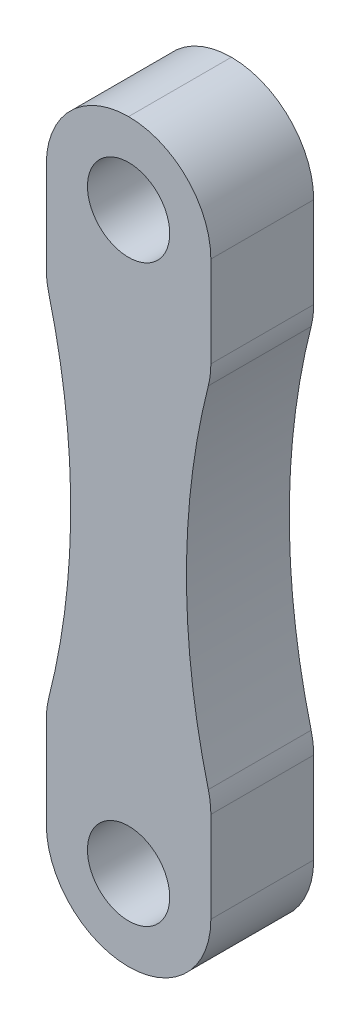
ISO-10303-21;
HEADER;
FILE_DESCRIPTION(('STEP AP214'),'2;1');
FILE_NAME('part.step','',(''),(''),'','','');
FILE_SCHEMA(('AUTOMOTIVE_DESIGN { 1 0 10303 214 1 1 1 1 }'));
ENDSEC;
DATA;
#1=APPLICATION_CONTEXT('core data for automotive mechanical design processes');
#2=APPLICATION_PROTOCOL_DEFINITION('international standard','automotive_design',2000,#1);
#3=PRODUCT_CONTEXT('',#1,'mechanical');
#4=PRODUCT('Part','Part','',(#3));
#5=PRODUCT_RELATED_PRODUCT_CATEGORY('part','',(#4));
#6=PRODUCT_DEFINITION_FORMATION('','',#4);
#7=PRODUCT_DEFINITION_CONTEXT('part definition',#1,'design');
#8=PRODUCT_DEFINITION('design','',#6,#7);
#9=PRODUCT_DEFINITION_SHAPE('','',#8);
#10=(LENGTH_UNIT() NAMED_UNIT(*) SI_UNIT(.MILLI.,.METRE.));
#11=(NAMED_UNIT(*) PLANE_ANGLE_UNIT() SI_UNIT($,.RADIAN.));
#12=(NAMED_UNIT(*) SI_UNIT($,.STERADIAN.) SOLID_ANGLE_UNIT());
#13=UNCERTAINTY_MEASURE_WITH_UNIT(LENGTH_MEASURE(1.E-05),#10,'distance_accuracy_value','');
#14=(GEOMETRIC_REPRESENTATION_CONTEXT(3) GLOBAL_UNCERTAINTY_ASSIGNED_CONTEXT((#13)) GLOBAL_UNIT_ASSIGNED_CONTEXT((#10,
#11,#12)) REPRESENTATION_CONTEXT('',''));
#15=CARTESIAN_POINT('',(0.,0.,0.));
#16=DIRECTION('',(0.,0.,1.));
#17=DIRECTION('',(1.,0.,0.));
#18=AXIS2_PLACEMENT_3D('',#15,#16,#17);
#19=CARTESIAN_POINT('',(8.00000000000015,35.8000000000003,5.));
#20=DIRECTION('',(-1.00000000000001,0.,0.));
#21=DIRECTION('',(0.,-1.00000000000001,0.));
#22=AXIS2_PLACEMENT_3D('',#19,#20,#21);
#23=PLANE('',#22);
#24=DIRECTION('',(0.,1.00000000000001,0.));
#25=VECTOR('',#24,1.);
#26=CARTESIAN_POINT('',(8.00000000000015,35.8000000000003,-4.99999999999997));
#27=LINE('',#26,#25);
#28=CARTESIAN_POINT('',(8.0000000000003,-27.8000000000002,-4.99999999999997));
#29=VERTEX_POINT('',#28);
#30=CARTESIAN_POINT('',(8.00000000000002,-18.9687028426324,-4.99999999999997));
#31=VERTEX_POINT('',#30);
#32=EDGE_CURVE('E307',#29,#31,#27,.T.);
#33=ORIENTED_EDGE('',*,*,#32,.T.);
#34=DIRECTION('',(0.,0.,-0.999999999999996));
#35=VECTOR('',#34,1.);
#36=CARTESIAN_POINT('',(8.00000000000013,-18.9687028426324,5.));
#37=LINE('',#36,#35);
#38=CARTESIAN_POINT('',(8.00000000000002,-18.9687028426324,5.));
#39=VERTEX_POINT('',#38);
#40=EDGE_CURVE('E257',#31,#39,#37,.F.);
#41=ORIENTED_EDGE('',*,*,#40,.T.);
#42=DIRECTION('',(0.,1.00000000000001,0.));
#43=VECTOR('',#42,1.);
#44=CARTESIAN_POINT('',(8.00000000000015,35.8000000000003,5.));
#45=LINE('',#44,#43);
#46=CARTESIAN_POINT('',(8.0000000000003,-27.8000000000002,5.));
#47=VERTEX_POINT('',#46);
#48=EDGE_CURVE('E198',#47,#39,#45,.T.);
#49=ORIENTED_EDGE('',*,*,#48,.F.);
#50=DIRECTION('',(0.,0.,-0.999999999999996));
#51=VECTOR('',#50,1.);
#52=CARTESIAN_POINT('',(8.00000000000021,-27.8000000000003,5.));
#53=LINE('',#52,#51);
#54=EDGE_CURVE('E253',#47,#29,#53,.T.);
#55=ORIENTED_EDGE('',*,*,#54,.T.);
#56=EDGE_LOOP('',(#33,#41,#49,#55));
#57=FACE_BOUND('',#56,.T.);
#58=ADVANCED_FACE('F47',(#57),#23,.F.);
#59=CARTESIAN_POINT('',(8.00000000000006,18.9687028426325,5.));
#60=VERTEX_POINT('',#59);
#61=CARTESIAN_POINT('',(8.00000000000013,27.8000000000003,5.));
#62=VERTEX_POINT('',#61);
#63=EDGE_CURVE('E300',#60,#62,#45,.T.);
#64=ORIENTED_EDGE('',*,*,#63,.F.);
#65=DIRECTION('',(0.,0.,-0.999999999999996));
#66=VECTOR('',#65,1.);
#67=CARTESIAN_POINT('',(8.00000000000008,18.9687028426325,-4.99999999999997));
#68=LINE('',#67,#66);
#69=CARTESIAN_POINT('',(8.00000000000006,18.9687028426325,-4.99999999999997));
#70=VERTEX_POINT('',#69);
#71=EDGE_CURVE('E11',#60,#70,#68,.T.);
#72=ORIENTED_EDGE('',*,*,#71,.T.);
#73=CARTESIAN_POINT('',(8.00000000000013,27.8000000000003,-4.99999999999997));
#74=VERTEX_POINT('',#73);
#75=EDGE_CURVE('E191',#70,#74,#27,.T.);
#76=ORIENTED_EDGE('',*,*,#75,.T.);
#77=DIRECTION('',(0.,0.,-0.999999999999996));
#78=VECTOR('',#77,1.);
#79=CARTESIAN_POINT('',(8.0000000000001,27.8000000000003,5.));
#80=LINE('',#79,#78);
#81=EDGE_CURVE('E57',#74,#62,#80,.F.);
#82=ORIENTED_EDGE('',*,*,#81,.T.);
#83=EDGE_LOOP('',(#64,#72,#76,#82));
#84=FACE_BOUND('',#83,.T.);
#85=ADVANCED_FACE('F366',(#84),#23,.F.);
#86=CARTESIAN_POINT('',(0.,0.,5.));
#87=DIRECTION('',(0.,0.,0.999999999999996));
#88=DIRECTION('',(1.00000000000001,0.,0.));
#89=AXIS2_PLACEMENT_3D('',#86,#87,#88);
#90=PLANE('',#89);
#91=CARTESIAN_POINT('',(0.,-27.9400000000002,5.));
#92=DIRECTION('',(0.,0.,-0.999999999999996));
#93=DIRECTION('',(1.00000000000001,0.,0.));
#94=AXIS2_PLACEMENT_3D('',#91,#92,#93);
#95=CIRCLE('',#94,4.);
#96=CARTESIAN_POINT('',(4.00000000000006,-27.9400000000002,5.));
#97=VERTEX_POINT('',#96);
#98=EDGE_CURVE('E179',#97,#97,#95,.T.);
#99=ORIENTED_EDGE('',*,*,#98,.T.);
#100=EDGE_LOOP('',(#99));
#101=FACE_BOUND('',#100,.T.);
#102=CARTESIAN_POINT('',(2.08166817117217E-13,27.9400000000004,5.));
#103=DIRECTION('',(0.,0.,0.999999999999996));
#104=DIRECTION('',(1.00000000000001,0.,0.));
#105=AXIS2_PLACEMENT_3D('',#102,#103,#104);
#106=CIRCLE('',#105,4.);
#107=CARTESIAN_POINT('',(4.00000000000025,27.9400000000004,5.));
#108=VERTEX_POINT('',#107);
#109=EDGE_CURVE('E309',#108,#108,#106,.T.);
#110=ORIENTED_EDGE('',*,*,#109,.F.);
#111=EDGE_LOOP('',(#110));
#112=FACE_BOUND('',#111,.T.);
#113=CARTESIAN_POINT('',(-74.6269945292454,0.,5.));
#114=DIRECTION('',(0.,0.,0.999999999999996));
#115=DIRECTION('',(1.00000000000001,0.,0.));
#116=AXIS2_PLACEMENT_3D('',#113,#114,#115);
#117=CIRCLE('',#116,69.);
#118=CARTESIAN_POINT('',(-7.75345397706433,-16.9979285213199,5.));
#119=VERTEX_POINT('',#118);
#120=CARTESIAN_POINT('',(-7.75345397706452,16.9979285213201,5.));
#121=VERTEX_POINT('',#120);
#122=EDGE_CURVE('E168',#119,#121,#117,.T.);
#123=ORIENTED_EDGE('',*,*,#122,.F.);
#124=CARTESIAN_POINT('',(0.,-18.9687028426323,5.));
#125=DIRECTION('',(0.,0.,0.999999999999996));
#126=DIRECTION('',(1.00000000000001,0.,0.));
#127=AXIS2_PLACEMENT_3D('',#124,#125,#126);
#128=CIRCLE('',#127,8.);
#129=CARTESIAN_POINT('',(-7.99999999999988,-18.9687028426323,5.));
#130=VERTEX_POINT('',#129);
#131=EDGE_CURVE('E150',#119,#130,#128,.T.);
#132=ORIENTED_EDGE('',*,*,#131,.T.);
#133=DIRECTION('',(0.,-1.00000000000001,0.));
#134=VECTOR('',#133,1.);
#135=CARTESIAN_POINT('',(-7.99999999999991,35.8000000000004,5.));
#136=LINE('',#135,#134);
#137=CARTESIAN_POINT('',(-7.99999999999995,-27.8000000000002,5.));
#138=VERTEX_POINT('',#137);
#139=EDGE_CURVE('E301',#130,#138,#136,.T.);
#140=ORIENTED_EDGE('',*,*,#139,.T.);
#141=CARTESIAN_POINT('',(0.,-27.8000000000002,5.));
#142=DIRECTION('',(0.,0.,0.999999999999996));
#143=DIRECTION('',(1.00000000000001,0.,0.));
#144=AXIS2_PLACEMENT_3D('',#141,#142,#143);
#145=CIRCLE('',#144,8.);
#146=CARTESIAN_POINT('',(0.,-35.8000000000003,5.));
#147=VERTEX_POINT('',#146);
#148=EDGE_CURVE('E205',#138,#147,#145,.T.);
#149=ORIENTED_EDGE('',*,*,#148,.T.);
#150=CARTESIAN_POINT('',(0.,-27.8000000000002,5.));
#151=DIRECTION('',(0.,0.,0.999999999999996));
#152=DIRECTION('',(1.00000000000001,0.,0.));
#153=AXIS2_PLACEMENT_3D('',#150,#151,#152);
#154=CIRCLE('',#153,8.);
#155=EDGE_CURVE('E208',#147,#47,#154,.T.);
#156=ORIENTED_EDGE('',*,*,#155,.T.);
#157=ORIENTED_EDGE('',*,*,#48,.T.);
#158=CARTESIAN_POINT('',(0.,-18.9687028426324,5.));
#159=DIRECTION('',(0.,0.,0.999999999999996));
#160=DIRECTION('',(1.00000000000001,0.,0.));
#161=AXIS2_PLACEMENT_3D('',#158,#159,#160);
#162=CIRCLE('',#161,8.);
#163=CARTESIAN_POINT('',(7.75345397706459,-16.9979285213199,5.));
#164=VERTEX_POINT('',#163);
#165=EDGE_CURVE('E214',#39,#164,#162,.T.);
#166=ORIENTED_EDGE('',*,*,#165,.T.);
#167=CARTESIAN_POINT('',(74.6269945292456,0.,5.));
#168=DIRECTION('',(0.,0.,0.999999999999996));
#169=DIRECTION('',(1.00000000000001,0.,0.));
#170=AXIS2_PLACEMENT_3D('',#167,#168,#169);
#171=CIRCLE('',#170,69.);
#172=CARTESIAN_POINT('',(7.75345397706455,16.9979285213199,5.));
#173=VERTEX_POINT('',#172);
#174=EDGE_CURVE('E187',#164,#173,#171,.F.);
#175=ORIENTED_EDGE('',*,*,#174,.T.);
#176=CARTESIAN_POINT('',(0.,18.9687028426325,5.));
#177=DIRECTION('',(0.,0.,0.999999999999996));
#178=DIRECTION('',(1.00000000000001,0.,0.));
#179=AXIS2_PLACEMENT_3D('',#176,#177,#178);
#180=CIRCLE('',#179,8.);
#181=EDGE_CURVE('E211',#173,#60,#180,.T.);
#182=ORIENTED_EDGE('',*,*,#181,.T.);
#183=ORIENTED_EDGE('',*,*,#63,.T.);
#184=CARTESIAN_POINT('',(0.,27.8000000000004,5.));
#185=DIRECTION('',(0.,0.,0.999999999999996));
#186=DIRECTION('',(1.00000000000001,0.,0.));
#187=AXIS2_PLACEMENT_3D('',#184,#185,#186);
#188=CIRCLE('',#187,8.);
#189=CARTESIAN_POINT('',(0.,35.8000000000003,5.));
#190=VERTEX_POINT('',#189);
#191=EDGE_CURVE('E202',#62,#190,#188,.T.);
#192=ORIENTED_EDGE('',*,*,#191,.T.);
#193=CARTESIAN_POINT('',(0.,27.8000000000004,5.));
#194=DIRECTION('',(0.,0.,0.999999999999996));
#195=DIRECTION('',(1.00000000000001,0.,0.));
#196=AXIS2_PLACEMENT_3D('',#193,#194,#195);
#197=CIRCLE('',#196,8.);
#198=CARTESIAN_POINT('',(-7.99999999999995,27.8000000000003,5.));
#199=VERTEX_POINT('',#198);
#200=EDGE_CURVE('E173',#190,#199,#197,.T.);
#201=ORIENTED_EDGE('',*,*,#200,.T.);
#202=CARTESIAN_POINT('',(-7.99999999999994,18.9687028426325,5.));
#203=VERTEX_POINT('',#202);
#204=EDGE_CURVE('E292',#199,#203,#136,.T.);
#205=ORIENTED_EDGE('',*,*,#204,.T.);
#206=CARTESIAN_POINT('',(0.,18.9687028426325,5.));
#207=DIRECTION('',(0.,0.,0.999999999999996));
#208=DIRECTION('',(1.00000000000001,0.,0.));
#209=AXIS2_PLACEMENT_3D('',#206,#207,#208);
#210=CIRCLE('',#209,8.);
#211=EDGE_CURVE('E162',#203,#121,#210,.T.);
#212=ORIENTED_EDGE('',*,*,#211,.T.);
#213=EDGE_LOOP('',(#123,#132,#140,#149,#156,#157,#166,#175,#182,#183,#192,#201,#205,#212));
#214=FACE_BOUND('',#213,.T.);
#215=ADVANCED_FACE('F176',(#101,#112,#214),#90,.T.);
#216=CARTESIAN_POINT('',(0.,0.,-4.99999999999997));
#217=DIRECTION('',(0.,0.,0.999999999999996));
#218=DIRECTION('',(1.00000000000001,0.,0.));
#219=AXIS2_PLACEMENT_3D('',#216,#217,#218);
#220=PLANE('',#219);
#221=CARTESIAN_POINT('',(2.08166817117217E-13,27.9400000000004,-4.99999999999997));
#222=DIRECTION('',(0.,0.,0.999999999999996));
#223=DIRECTION('',(1.00000000000001,0.,0.));
#224=AXIS2_PLACEMENT_3D('',#221,#222,#223);
#225=CIRCLE('',#224,4.);
#226=CARTESIAN_POINT('',(4.00000000000025,27.9400000000004,-4.99999999999997));
#227=VERTEX_POINT('',#226);
#228=EDGE_CURVE('E318',#227,#227,#225,.T.);
#229=ORIENTED_EDGE('',*,*,#228,.T.);
#230=EDGE_LOOP('',(#229));
#231=FACE_BOUND('',#230,.T.);
#232=CARTESIAN_POINT('',(0.,-27.9400000000002,-4.99999999999997));
#233=DIRECTION('',(0.,0.,-0.999999999999996));
#234=DIRECTION('',(1.00000000000001,0.,0.));
#235=AXIS2_PLACEMENT_3D('',#232,#233,#234);
#236=CIRCLE('',#235,4.);
#237=CARTESIAN_POINT('',(4.00000000000006,-27.9400000000002,-4.99999999999997));
#238=VERTEX_POINT('',#237);
#239=EDGE_CURVE('E185',#238,#238,#236,.T.);
#240=ORIENTED_EDGE('',*,*,#239,.F.);
#241=EDGE_LOOP('',(#240));
#242=FACE_BOUND('',#241,.T.);
#243=DIRECTION('',(0.,-1.00000000000001,0.));
#244=VECTOR('',#243,1.);
#245=CARTESIAN_POINT('',(-7.99999999999991,35.8000000000004,-4.99999999999997));
#246=LINE('',#245,#244);
#247=CARTESIAN_POINT('',(-7.99999999999988,-18.9687028426323,-4.99999999999997));
#248=VERTEX_POINT('',#247);
#249=CARTESIAN_POINT('',(-7.99999999999995,-27.8000000000002,-4.99999999999997));
#250=VERTEX_POINT('',#249);
#251=EDGE_CURVE('E313',#248,#250,#246,.T.);
#252=ORIENTED_EDGE('',*,*,#251,.F.);
#253=CARTESIAN_POINT('',(0.,-18.9687028426323,-4.99999999999997));
#254=DIRECTION('',(0.,0.,0.999999999999996));
#255=DIRECTION('',(1.00000000000001,0.,0.));
#256=AXIS2_PLACEMENT_3D('',#253,#254,#255);
#257=CIRCLE('',#256,8.);
#258=CARTESIAN_POINT('',(-7.75345397706433,-16.9979285213199,-4.99999999999997));
#259=VERTEX_POINT('',#258);
#260=EDGE_CURVE('E243',#248,#259,#257,.F.);
#261=ORIENTED_EDGE('',*,*,#260,.T.);
#262=CARTESIAN_POINT('',(-74.6269945292454,0.,-4.99999999999997));
#263=DIRECTION('',(0.,0.,0.999999999999996));
#264=DIRECTION('',(-1.00000000000001,0.,0.));
#265=AXIS2_PLACEMENT_3D('',#262,#263,#264);
#266=CIRCLE('',#265,69.);
#267=CARTESIAN_POINT('',(-7.75345397706452,16.9979285213201,-4.99999999999997));
#268=VERTEX_POINT('',#267);
#269=EDGE_CURVE('E171',#259,#268,#266,.T.);
#270=ORIENTED_EDGE('',*,*,#269,.T.);
#271=CARTESIAN_POINT('',(0.,18.9687028426325,-4.99999999999997));
#272=DIRECTION('',(0.,0.,0.999999999999996));
#273=DIRECTION('',(1.00000000000001,0.,0.));
#274=AXIS2_PLACEMENT_3D('',#271,#272,#273);
#275=CIRCLE('',#274,8.);
#276=CARTESIAN_POINT('',(-7.99999999999994,18.9687028426325,-4.99999999999997));
#277=VERTEX_POINT('',#276);
#278=EDGE_CURVE('E240',#268,#277,#275,.F.);
#279=ORIENTED_EDGE('',*,*,#278,.T.);
#280=CARTESIAN_POINT('',(-7.99999999999995,27.8000000000003,-4.99999999999997));
#281=VERTEX_POINT('',#280);
#282=EDGE_CURVE('E311',#281,#277,#246,.T.);
#283=ORIENTED_EDGE('',*,*,#282,.F.);
#284=CARTESIAN_POINT('',(0.,27.8000000000004,-4.99999999999997));
#285=DIRECTION('',(0.,0.,0.999999999999996));
#286=DIRECTION('',(1.00000000000001,0.,0.));
#287=AXIS2_PLACEMENT_3D('',#284,#285,#286);
#288=CIRCLE('',#287,8.);
#289=CARTESIAN_POINT('',(0.,35.8000000000003,-4.99999999999997));
#290=VERTEX_POINT('',#289);
#291=EDGE_CURVE('E223',#281,#290,#288,.F.);
#292=ORIENTED_EDGE('',*,*,#291,.T.);
#293=CARTESIAN_POINT('',(0.,27.8000000000004,-4.99999999999997));
#294=DIRECTION('',(0.,0.,0.999999999999996));
#295=DIRECTION('',(1.00000000000001,0.,0.));
#296=AXIS2_PLACEMENT_3D('',#293,#294,#295);
#297=CIRCLE('',#296,8.);
#298=EDGE_CURVE('E65',#290,#74,#297,.F.);
#299=ORIENTED_EDGE('',*,*,#298,.T.);
#300=ORIENTED_EDGE('',*,*,#75,.F.);
#301=CARTESIAN_POINT('',(0.,18.9687028426325,-4.99999999999997));
#302=DIRECTION('',(0.,0.,0.999999999999996));
#303=DIRECTION('',(1.00000000000001,0.,0.));
#304=AXIS2_PLACEMENT_3D('',#301,#302,#303);
#305=CIRCLE('',#304,8.);
#306=CARTESIAN_POINT('',(7.75345397706455,16.9979285213199,-4.99999999999997));
#307=VERTEX_POINT('',#306);
#308=EDGE_CURVE('E234',#70,#307,#305,.F.);
#309=ORIENTED_EDGE('',*,*,#308,.T.);
#310=CARTESIAN_POINT('',(74.6269945292456,0.,-4.99999999999997));
#311=DIRECTION('',(0.,0.,-0.999999999999996));
#312=DIRECTION('',(1.00000000000001,0.,0.));
#313=AXIS2_PLACEMENT_3D('',#310,#311,#312);
#314=CIRCLE('',#313,69.);
#315=CARTESIAN_POINT('',(7.75345397706459,-16.9979285213199,-4.99999999999997));
#316=VERTEX_POINT('',#315);
#317=EDGE_CURVE('E196',#316,#307,#314,.T.);
#318=ORIENTED_EDGE('',*,*,#317,.F.);
#319=CARTESIAN_POINT('',(0.,-18.9687028426324,-4.99999999999997));
#320=DIRECTION('',(0.,0.,0.999999999999996));
#321=DIRECTION('',(1.00000000000001,0.,0.));
#322=AXIS2_PLACEMENT_3D('',#319,#320,#321);
#323=CIRCLE('',#322,8.);
#324=EDGE_CURVE('E237',#316,#31,#323,.F.);
#325=ORIENTED_EDGE('',*,*,#324,.T.);
#326=ORIENTED_EDGE('',*,*,#32,.F.);
#327=CARTESIAN_POINT('',(0.,-27.8000000000002,-4.99999999999997));
#328=DIRECTION('',(0.,0.,0.999999999999996));
#329=DIRECTION('',(1.00000000000001,0.,0.));
#330=AXIS2_PLACEMENT_3D('',#327,#328,#329);
#331=CIRCLE('',#330,8.);
#332=CARTESIAN_POINT('',(0.,-35.8000000000003,-4.99999999999997));
#333=VERTEX_POINT('',#332);
#334=EDGE_CURVE('E231',#29,#333,#331,.F.);
#335=ORIENTED_EDGE('',*,*,#334,.T.);
#336=CARTESIAN_POINT('',(0.,-27.8000000000002,-4.99999999999997));
#337=DIRECTION('',(0.,0.,0.999999999999996));
#338=DIRECTION('',(1.00000000000001,0.,0.));
#339=AXIS2_PLACEMENT_3D('',#336,#337,#338);
#340=CIRCLE('',#339,8.);
#341=EDGE_CURVE('E228',#333,#250,#340,.F.);
#342=ORIENTED_EDGE('',*,*,#341,.T.);
#343=EDGE_LOOP('',(#252,#261,#270,#279,#283,#292,#299,#300,#309,#318,#325,#326,#335,#342));
#344=FACE_BOUND('',#343,.T.);
#345=ADVANCED_FACE('F339',(#231,#242,#344),#220,.F.);
#346=CARTESIAN_POINT('',(-7.99999999999991,35.8000000000004,5.));
#347=DIRECTION('',(1.00000000000001,0.,0.));
#348=DIRECTION('',(0.,1.00000000000001,0.));
#349=AXIS2_PLACEMENT_3D('',#346,#347,#348);
#350=PLANE('',#349);
#351=ORIENTED_EDGE('',*,*,#282,.T.);
#352=DIRECTION('',(0.,0.,0.999999999999996));
#353=VECTOR('',#352,1.);
#354=CARTESIAN_POINT('',(-8.00000000000006,18.9687028426324,5.));
#355=LINE('',#354,#353);
#356=EDGE_CURVE('E249',#277,#203,#355,.T.);
#357=ORIENTED_EDGE('',*,*,#356,.T.);
#358=ORIENTED_EDGE('',*,*,#204,.F.);
#359=DIRECTION('',(0.,0.,-0.999999999999996));
#360=VECTOR('',#359,1.);
#361=CARTESIAN_POINT('',(-7.99999999999995,27.8000000000003,5.));
#362=LINE('',#361,#360);
#363=EDGE_CURVE('E246',#199,#281,#362,.T.);
#364=ORIENTED_EDGE('',*,*,#363,.T.);
#365=EDGE_LOOP('',(#351,#357,#358,#364));
#366=FACE_BOUND('',#365,.T.);
#367=ADVANCED_FACE('F296',(#366),#350,.F.);
#368=ORIENTED_EDGE('',*,*,#139,.F.);
#369=DIRECTION('',(0.,0.,0.999999999999996));
#370=VECTOR('',#369,1.);
#371=CARTESIAN_POINT('',(-7.99999999999994,-18.9687028426324,5.));
#372=LINE('',#371,#370);
#373=EDGE_CURVE('E155',#130,#248,#372,.F.);
#374=ORIENTED_EDGE('',*,*,#373,.T.);
#375=ORIENTED_EDGE('',*,*,#251,.T.);
#376=DIRECTION('',(0.,0.,-0.999999999999996));
#377=VECTOR('',#376,1.);
#378=CARTESIAN_POINT('',(-7.9999999999999,-27.8000000000003,5.));
#379=LINE('',#378,#377);
#380=EDGE_CURVE('E161',#250,#138,#379,.F.);
#381=ORIENTED_EDGE('',*,*,#380,.T.);
#382=EDGE_LOOP('',(#368,#374,#375,#381));
#383=FACE_BOUND('',#382,.T.);
#384=ADVANCED_FACE('F347',(#383),#350,.F.);
#385=CARTESIAN_POINT('',(2.08166817117217E-13,27.9400000000004,-4.99999999999997));
#386=DIRECTION('',(0.,0.,0.999999999999996));
#387=DIRECTION('',(1.00000000000001,0.,0.));
#388=AXIS2_PLACEMENT_3D('',#385,#386,#387);
#389=CYLINDRICAL_SURFACE('',#388,4.);
#390=CARTESIAN_POINT('',(4.00000000000025,27.9400000000004,-4.99999999999997));
#391=CARTESIAN_POINT('',(4.00000000000025,27.9400000000004,-4.8958333333333));
#392=CARTESIAN_POINT('',(4.00000000000025,27.9400000000004,-4.79166666666664));
#393=CARTESIAN_POINT('',(4.00000000000025,27.9400000000004,-4.5833333333333));
#394=CARTESIAN_POINT('',(4.00000000000025,27.9400000000004,-4.47916666666664));
#395=CARTESIAN_POINT('',(4.00000000000025,27.9400000000004,-4.27083333333331));
#396=CARTESIAN_POINT('',(4.00000000000025,27.9400000000004,-4.16666666666664));
#397=CARTESIAN_POINT('',(4.00000000000025,27.9400000000004,-3.95833333333331));
#398=CARTESIAN_POINT('',(4.00000000000025,27.9400000000004,-3.85416666666664));
#399=CARTESIAN_POINT('',(4.00000000000025,27.9400000000004,-3.64583333333331));
#400=CARTESIAN_POINT('',(4.00000000000025,27.9400000000004,-3.54166666666664));
#401=CARTESIAN_POINT('',(4.00000000000025,27.9400000000004,-3.33333333333331));
#402=CARTESIAN_POINT('',(4.00000000000025,27.9400000000004,-3.22916666666664));
#403=CARTESIAN_POINT('',(4.00000000000025,27.9400000000004,-3.02083333333331));
#404=CARTESIAN_POINT('',(4.00000000000025,27.9400000000004,-2.91666666666664));
#405=CARTESIAN_POINT('',(4.00000000000025,27.9400000000004,-2.70833333333331));
#406=CARTESIAN_POINT('',(4.00000000000025,27.9400000000004,-2.60416666666664));
#407=CARTESIAN_POINT('',(4.00000000000025,27.9400000000004,-2.39583333333331));
#408=CARTESIAN_POINT('',(4.00000000000025,27.9400000000004,-2.29166666666665));
#409=CARTESIAN_POINT('',(4.00000000000025,27.9400000000004,-2.08333333333331));
#410=CARTESIAN_POINT('',(4.00000000000025,27.9400000000004,-1.97916666666665));
#411=CARTESIAN_POINT('',(4.00000000000025,27.9400000000004,-1.77083333333331));
#412=CARTESIAN_POINT('',(4.00000000000025,27.9400000000004,-1.66666666666665));
#413=CARTESIAN_POINT('',(4.00000000000025,27.9400000000004,-1.45833333333331));
#414=CARTESIAN_POINT('',(4.00000000000025,27.9400000000004,-1.35416666666665));
#415=CARTESIAN_POINT('',(4.00000000000025,27.9400000000004,-1.14583333333332));
#416=CARTESIAN_POINT('',(4.00000000000025,27.9400000000004,-1.04166666666665));
#417=CARTESIAN_POINT('',(4.00000000000025,27.9400000000004,-0.833333333333316));
#418=CARTESIAN_POINT('',(4.00000000000025,27.9400000000004,-0.72916666666665));
#419=CARTESIAN_POINT('',(4.00000000000025,27.9400000000004,-0.520833333333317));
#420=CARTESIAN_POINT('',(4.00000000000025,27.9400000000004,-0.416666666666651));
#421=CARTESIAN_POINT('',(4.00000000000025,27.9400000000004,-0.208333333333318));
#422=CARTESIAN_POINT('',(4.00000000000025,27.9400000000004,-0.104166666666652));
#423=CARTESIAN_POINT('',(4.00000000000025,27.9400000000004,0.104166666666681));
#424=CARTESIAN_POINT('',(4.00000000000025,27.9400000000004,0.208333333333348));
#425=CARTESIAN_POINT('',(4.00000000000025,27.9400000000004,0.41666666666668));
#426=CARTESIAN_POINT('',(4.00000000000025,27.9400000000004,0.520833333333347));
#427=CARTESIAN_POINT('',(4.00000000000025,27.9400000000004,0.729166666666679));
#428=CARTESIAN_POINT('',(4.00000000000025,27.9400000000004,0.833333333333346));
#429=CARTESIAN_POINT('',(4.00000000000025,27.9400000000004,1.04166666666668));
#430=CARTESIAN_POINT('',(4.00000000000025,27.9400000000004,1.14583333333334));
#431=CARTESIAN_POINT('',(4.00000000000025,27.9400000000004,1.35416666666668));
#432=CARTESIAN_POINT('',(4.00000000000025,27.9400000000004,1.45833333333334));
#433=CARTESIAN_POINT('',(4.00000000000025,27.9400000000004,1.66666666666668));
#434=CARTESIAN_POINT('',(4.00000000000025,27.9400000000004,1.77083333333334));
#435=CARTESIAN_POINT('',(4.00000000000025,27.9400000000004,1.97916666666668));
#436=CARTESIAN_POINT('',(4.00000000000025,27.9400000000004,2.08333333333334));
#437=CARTESIAN_POINT('',(4.00000000000025,27.9400000000004,2.29166666666667));
#438=CARTESIAN_POINT('',(4.00000000000025,27.9400000000004,2.39583333333334));
#439=CARTESIAN_POINT('',(4.00000000000025,27.9400000000004,2.60416666666667));
#440=CARTESIAN_POINT('',(4.00000000000025,27.9400000000004,2.70833333333334));
#441=CARTESIAN_POINT('',(4.00000000000025,27.9400000000004,2.91666666666667));
#442=CARTESIAN_POINT('',(4.00000000000025,27.9400000000004,3.02083333333334));
#443=CARTESIAN_POINT('',(4.00000000000025,27.9400000000004,3.22916666666667));
#444=CARTESIAN_POINT('',(4.00000000000025,27.9400000000004,3.33333333333334));
#445=CARTESIAN_POINT('',(4.00000000000025,27.9400000000004,3.54166666666667));
#446=CARTESIAN_POINT('',(4.00000000000025,27.9400000000004,3.64583333333334));
#447=CARTESIAN_POINT('',(4.00000000000025,27.9400000000004,3.85416666666667));
#448=CARTESIAN_POINT('',(4.00000000000025,27.9400000000004,3.95833333333334));
#449=CARTESIAN_POINT('',(4.00000000000025,27.9400000000004,4.16666666666667));
#450=CARTESIAN_POINT('',(4.00000000000025,27.9400000000004,4.27083333333333));
#451=CARTESIAN_POINT('',(4.00000000000025,27.9400000000004,4.47916666666667));
#452=CARTESIAN_POINT('',(4.00000000000025,27.9400000000004,4.58333333333333));
#453=CARTESIAN_POINT('',(4.00000000000025,27.9400000000004,4.79166666666667));
#454=CARTESIAN_POINT('',(4.00000000000025,27.9400000000004,4.89583333333333));
#455=CARTESIAN_POINT('',(4.00000000000025,27.9400000000004,5.));
#456=B_SPLINE_CURVE_WITH_KNOTS('',3,(#390,#391,#392,#393,#394,#395,#396,#397,#398,#399,#400,
#401,#402,#403,#404,#405,#406,#407,#408,#409,#410,#411,#412,#413,#414,#415,#416,#417,#418,#419,
#420,#421,#422,#423,#424,#425,#426,#427,#428,#429,#430,#431,#432,#433,#434,#435,#436,#437,#438,
#439,#440,#441,#442,#443,#444,#445,#446,#447,#448,#449,#450,#451,#452,#453,#454,#455),
.UNSPECIFIED.,.F.,.F.,(4,2,2,2,2,2,2,2,2,2,2,2,2,2,2,2,2,2,2,2,2,2,2,2,2,2,2,2,2,2,2,2,4),(0.,
0.312499999999999,0.624999999999998,0.937499999999996,1.25,1.56249999999999,1.87499999999999,
2.18749999999999,2.49999999999999,2.81249999999999,3.12499999999999,3.43749999999999,
3.74999999999999,4.06249999999999,4.37499999999999,4.68749999999998,4.99999999999998,
5.31249999999998,5.62499999999998,5.93749999999998,6.24999999999998,6.56249999999998,
6.87499999999998,7.18749999999998,7.49999999999998,7.81249999999998,8.12499999999998,
8.43749999999998,8.74999999999997,9.06249999999997,9.37499999999997,9.68749999999997,
9.99999999999997),.UNSPECIFIED.);
#457=EDGE_CURVE('BSEAM375',#227,#108,#456,.T.);
#458=ORIENTED_EDGE('',*,*,#228,.F.);
#459=ORIENTED_EDGE('',*,*,#109,.T.);
#460=ORIENTED_EDGE('',*,*,#457,.T.);
#461=ORIENTED_EDGE('',*,*,#457,.F.);
#462=EDGE_LOOP('',(#458,#460,#459,#461));
#463=FACE_BOUND('',#462,.T.);
#464=ADVANCED_FACE('F375',(#463),#389,.F.);
#465=CARTESIAN_POINT('',(0.,-27.9400000000002,-4.99999999999997));
#466=DIRECTION('',(0.,0.,0.999999999999996));
#467=DIRECTION('',(1.00000000000001,0.,0.));
#468=AXIS2_PLACEMENT_3D('',#465,#466,#467);
#469=CYLINDRICAL_SURFACE('',#468,4.);
#470=CARTESIAN_POINT('',(4.00000000000006,-27.9400000000002,-4.99999999999997));
#471=CARTESIAN_POINT('',(4.00000000000006,-27.9400000000002,-4.8958333333333));
#472=CARTESIAN_POINT('',(4.00000000000006,-27.9400000000002,-4.79166666666664));
#473=CARTESIAN_POINT('',(4.00000000000006,-27.9400000000002,-4.5833333333333));
#474=CARTESIAN_POINT('',(4.00000000000006,-27.9400000000002,-4.47916666666664));
#475=CARTESIAN_POINT('',(4.00000000000006,-27.9400000000002,-4.2708333333333));
#476=CARTESIAN_POINT('',(4.00000000000006,-27.9400000000002,-4.16666666666664));
#477=CARTESIAN_POINT('',(4.00000000000006,-27.9400000000002,-3.95833333333331));
#478=CARTESIAN_POINT('',(4.00000000000006,-27.9400000000002,-3.85416666666664));
#479=CARTESIAN_POINT('',(4.00000000000006,-27.9400000000002,-3.64583333333331));
#480=CARTESIAN_POINT('',(4.00000000000006,-27.9400000000002,-3.54166666666664));
#481=CARTESIAN_POINT('',(4.00000000000006,-27.9400000000002,-3.33333333333331));
#482=CARTESIAN_POINT('',(4.00000000000006,-27.9400000000002,-3.22916666666664));
#483=CARTESIAN_POINT('',(4.00000000000006,-27.9400000000002,-3.02083333333331));
#484=CARTESIAN_POINT('',(4.00000000000006,-27.9400000000002,-2.91666666666664));
#485=CARTESIAN_POINT('',(4.00000000000006,-27.9400000000002,-2.70833333333331));
#486=CARTESIAN_POINT('',(4.00000000000006,-27.9400000000002,-2.60416666666664));
#487=CARTESIAN_POINT('',(4.00000000000006,-27.9400000000002,-2.39583333333331));
#488=CARTESIAN_POINT('',(4.00000000000006,-27.9400000000002,-2.29166666666664));
#489=CARTESIAN_POINT('',(4.00000000000006,-27.9400000000002,-2.08333333333331));
#490=CARTESIAN_POINT('',(4.00000000000006,-27.9400000000002,-1.97916666666664));
#491=CARTESIAN_POINT('',(4.00000000000006,-27.9400000000002,-1.77083333333331));
#492=CARTESIAN_POINT('',(4.00000000000006,-27.9400000000002,-1.66666666666665));
#493=CARTESIAN_POINT('',(4.00000000000006,-27.9400000000002,-1.45833333333331));
#494=CARTESIAN_POINT('',(4.00000000000006,-27.9400000000002,-1.35416666666665));
#495=CARTESIAN_POINT('',(4.00000000000006,-27.9400000000002,-1.14583333333331));
#496=CARTESIAN_POINT('',(4.00000000000006,-27.9400000000002,-1.04166666666665));
#497=CARTESIAN_POINT('',(4.00000000000006,-27.9400000000002,-0.833333333333314));
#498=CARTESIAN_POINT('',(4.00000000000006,-27.9400000000002,-0.729166666666648));
#499=CARTESIAN_POINT('',(4.00000000000006,-27.9400000000002,-0.520833333333315));
#500=CARTESIAN_POINT('',(4.00000000000006,-27.9400000000002,-0.416666666666649));
#501=CARTESIAN_POINT('',(4.00000000000006,-27.9400000000002,-0.208333333333316));
#502=CARTESIAN_POINT('',(4.00000000000006,-27.9400000000002,-0.10416666666665));
#503=CARTESIAN_POINT('',(4.00000000000006,-27.9400000000002,0.104166666666683));
#504=CARTESIAN_POINT('',(4.00000000000006,-27.9400000000002,0.208333333333349));
#505=CARTESIAN_POINT('',(4.00000000000006,-27.9400000000002,0.416666666666682));
#506=CARTESIAN_POINT('',(4.00000000000006,-27.9400000000002,0.520833333333348));
#507=CARTESIAN_POINT('',(4.00000000000006,-27.9400000000002,0.729166666666681));
#508=CARTESIAN_POINT('',(4.00000000000006,-27.9400000000002,0.833333333333347));
#509=CARTESIAN_POINT('',(4.00000000000006,-27.9400000000002,1.04166666666668));
#510=CARTESIAN_POINT('',(4.00000000000006,-27.9400000000002,1.14583333333335));
#511=CARTESIAN_POINT('',(4.00000000000006,-27.9400000000002,1.35416666666668));
#512=CARTESIAN_POINT('',(4.00000000000006,-27.9400000000002,1.45833333333335));
#513=CARTESIAN_POINT('',(4.00000000000006,-27.9400000000002,1.66666666666668));
#514=CARTESIAN_POINT('',(4.00000000000006,-27.9400000000002,1.77083333333335));
#515=CARTESIAN_POINT('',(4.00000000000006,-27.9400000000002,1.97916666666668));
#516=CARTESIAN_POINT('',(4.00000000000006,-27.9400000000002,2.08333333333334));
#517=CARTESIAN_POINT('',(4.00000000000006,-27.9400000000002,2.29166666666668));
#518=CARTESIAN_POINT('',(4.00000000000006,-27.9400000000002,2.39583333333334));
#519=CARTESIAN_POINT('',(4.00000000000006,-27.9400000000002,2.60416666666668));
#520=CARTESIAN_POINT('',(4.00000000000006,-27.9400000000002,2.70833333333334));
#521=CARTESIAN_POINT('',(4.00000000000006,-27.9400000000002,2.91666666666668));
#522=CARTESIAN_POINT('',(4.00000000000006,-27.9400000000002,3.02083333333334));
#523=CARTESIAN_POINT('',(4.00000000000006,-27.9400000000002,3.22916666666667));
#524=CARTESIAN_POINT('',(4.00000000000006,-27.9400000000002,3.33333333333334));
#525=CARTESIAN_POINT('',(4.00000000000006,-27.9400000000002,3.54166666666667));
#526=CARTESIAN_POINT('',(4.00000000000006,-27.9400000000002,3.64583333333334));
#527=CARTESIAN_POINT('',(4.00000000000006,-27.9400000000002,3.85416666666667));
#528=CARTESIAN_POINT('',(4.00000000000006,-27.9400000000002,3.95833333333334));
#529=CARTESIAN_POINT('',(4.00000000000006,-27.9400000000002,4.16666666666667));
#530=CARTESIAN_POINT('',(4.00000000000006,-27.9400000000002,4.27083333333334));
#531=CARTESIAN_POINT('',(4.00000000000006,-27.9400000000002,4.47916666666667));
#532=CARTESIAN_POINT('',(4.00000000000006,-27.9400000000002,4.58333333333334));
#533=CARTESIAN_POINT('',(4.00000000000006,-27.9400000000002,4.79166666666667));
#534=CARTESIAN_POINT('',(4.00000000000006,-27.9400000000002,4.89583333333334));
#535=CARTESIAN_POINT('',(4.00000000000006,-27.9400000000002,5.));
#536=B_SPLINE_CURVE_WITH_KNOTS('',3,(#470,#471,#472,#473,#474,#475,#476,#477,#478,#479,#480,
#481,#482,#483,#484,#485,#486,#487,#488,#489,#490,#491,#492,#493,#494,#495,#496,#497,#498,#499,
#500,#501,#502,#503,#504,#505,#506,#507,#508,#509,#510,#511,#512,#513,#514,#515,#516,#517,#518,
#519,#520,#521,#522,#523,#524,#525,#526,#527,#528,#529,#530,#531,#532,#533,#534,#535),
.UNSPECIFIED.,.F.,.F.,(4,2,2,2,2,2,2,2,2,2,2,2,2,2,2,2,2,2,2,2,2,2,2,2,2,2,2,2,2,2,2,2,4),(0.,
0.312499999999999,0.624999999999999,0.937499999999997,1.25,1.5625,1.875,2.18749999999999,
2.49999999999999,2.81249999999999,3.12499999999999,3.43749999999999,3.74999999999999,
4.06249999999999,4.37499999999999,4.68749999999999,4.99999999999999,5.31249999999999,
5.62499999999998,5.93749999999998,6.24999999999998,6.56249999999998,6.87499999999998,
7.18749999999998,7.49999999999998,7.81249999999998,8.12499999999998,8.43749999999998,
8.74999999999998,9.06249999999998,9.37499999999997,9.68749999999997,9.99999999999997),.UNSPECIFIED.);
#537=EDGE_CURVE('BSEAM336',#238,#97,#536,.T.);
#538=ORIENTED_EDGE('',*,*,#239,.T.);
#539=ORIENTED_EDGE('',*,*,#98,.F.);
#540=ORIENTED_EDGE('',*,*,#537,.T.);
#541=ORIENTED_EDGE('',*,*,#537,.F.);
#542=EDGE_LOOP('',(#538,#540,#539,#541));
#543=FACE_BOUND('',#542,.T.);
#544=ADVANCED_FACE('F336',(#543),#469,.F.);
#545=CARTESIAN_POINT('',(-74.6269945292454,0.,-4.99999999999997));
#546=DIRECTION('',(0.,0.,0.999999999999996));
#547=DIRECTION('',(1.00000000000001,0.,0.));
#548=AXIS2_PLACEMENT_3D('',#545,#546,#547);
#549=CYLINDRICAL_SURFACE('',#548,69.);
#550=ORIENTED_EDGE('',*,*,#269,.F.);
#551=DIRECTION('',(0.,0.,0.999999999999996));
#552=VECTOR('',#551,1.);
#553=CARTESIAN_POINT('',(-7.75345397706433,-16.9979285213199,-4.99999999999997));
#554=LINE('',#553,#552);
#555=EDGE_CURVE('E154',#259,#119,#554,.T.);
#556=ORIENTED_EDGE('',*,*,#555,.T.);
#557=ORIENTED_EDGE('',*,*,#122,.T.);
#558=DIRECTION('',(0.,0.,0.999999999999996));
#559=VECTOR('',#558,1.);
#560=CARTESIAN_POINT('',(-7.75345397706452,16.9979285213201,-4.99999999999997));
#561=LINE('',#560,#559);
#562=EDGE_CURVE('E174',#121,#268,#561,.F.);
#563=ORIENTED_EDGE('',*,*,#562,.T.);
#564=EDGE_LOOP('',(#550,#556,#557,#563));
#565=FACE_BOUND('',#564,.T.);
#566=ADVANCED_FACE('F167',(#565),#549,.F.);
#567=CARTESIAN_POINT('',(74.6269945292456,0.,-4.99999999999997));
#568=DIRECTION('',(0.,0.,0.999999999999996));
#569=DIRECTION('',(1.00000000000001,0.,0.));
#570=AXIS2_PLACEMENT_3D('',#567,#568,#569);
#571=CYLINDRICAL_SURFACE('',#570,69.);
#572=ORIENTED_EDGE('',*,*,#174,.F.);
#573=DIRECTION('',(0.,0.,0.999999999999996));
#574=VECTOR('',#573,1.);
#575=CARTESIAN_POINT('',(7.75345397706458,-16.99792852132,-4.99999999999997));
#576=LINE('',#575,#574);
#577=EDGE_CURVE('E265',#164,#316,#576,.F.);
#578=ORIENTED_EDGE('',*,*,#577,.T.);
#579=ORIENTED_EDGE('',*,*,#317,.T.);
#580=DIRECTION('',(0.,0.,0.999999999999996));
#581=VECTOR('',#580,1.);
#582=CARTESIAN_POINT('',(7.7534539770647,16.99792852132,-4.99999999999997));
#583=LINE('',#582,#581);
#584=EDGE_CURVE('E261',#307,#173,#583,.T.);
#585=ORIENTED_EDGE('',*,*,#584,.T.);
#586=EDGE_LOOP('',(#572,#578,#579,#585));
#587=FACE_BOUND('',#586,.T.);
#588=ADVANCED_FACE('F379',(#587),#571,.F.);
#589=CARTESIAN_POINT('',(0.,-18.9687028426323,-4.99999999999997));
#590=DIRECTION('',(0.,0.,0.999999999999996));
#591=DIRECTION('',(1.00000000000001,0.,0.));
#592=AXIS2_PLACEMENT_3D('',#589,#590,#591);
#593=CYLINDRICAL_SURFACE('',#592,8.);
#594=ORIENTED_EDGE('',*,*,#260,.F.);
#595=ORIENTED_EDGE('',*,*,#373,.F.);
#596=ORIENTED_EDGE('',*,*,#131,.F.);
#597=ORIENTED_EDGE('',*,*,#555,.F.);
#598=EDGE_LOOP('',(#594,#595,#596,#597));
#599=FACE_BOUND('',#598,.T.);
#600=ADVANCED_FACE('F153',(#599),#593,.T.);
#601=CARTESIAN_POINT('',(0.,18.9687028426325,-4.99999999999997));
#602=DIRECTION('',(0.,0.,0.999999999999996));
#603=DIRECTION('',(1.00000000000001,0.,0.));
#604=AXIS2_PLACEMENT_3D('',#601,#602,#603);
#605=CYLINDRICAL_SURFACE('',#604,8.);
#606=ORIENTED_EDGE('',*,*,#278,.F.);
#607=ORIENTED_EDGE('',*,*,#562,.F.);
#608=ORIENTED_EDGE('',*,*,#211,.F.);
#609=ORIENTED_EDGE('',*,*,#356,.F.);
#610=EDGE_LOOP('',(#606,#607,#608,#609));
#611=FACE_BOUND('',#610,.T.);
#612=ADVANCED_FACE('F378',(#611),#605,.T.);
#613=CARTESIAN_POINT('',(0.,-18.9687028426324,-4.99999999999997));
#614=DIRECTION('',(0.,0.,0.999999999999996));
#615=DIRECTION('',(1.00000000000001,0.,0.));
#616=AXIS2_PLACEMENT_3D('',#613,#614,#615);
#617=CYLINDRICAL_SURFACE('',#616,8.);
#618=ORIENTED_EDGE('',*,*,#324,.F.);
#619=ORIENTED_EDGE('',*,*,#577,.F.);
#620=ORIENTED_EDGE('',*,*,#165,.F.);
#621=ORIENTED_EDGE('',*,*,#40,.F.);
#622=EDGE_LOOP('',(#618,#619,#620,#621));
#623=FACE_BOUND('',#622,.T.);
#624=ADVANCED_FACE('F382',(#623),#617,.T.);
#625=CARTESIAN_POINT('',(0.,18.9687028426325,-4.99999999999997));
#626=DIRECTION('',(0.,0.,0.999999999999996));
#627=DIRECTION('',(1.00000000000001,0.,0.));
#628=AXIS2_PLACEMENT_3D('',#625,#626,#627);
#629=CYLINDRICAL_SURFACE('',#628,8.);
#630=ORIENTED_EDGE('',*,*,#308,.F.);
#631=ORIENTED_EDGE('',*,*,#71,.F.);
#632=ORIENTED_EDGE('',*,*,#181,.F.);
#633=ORIENTED_EDGE('',*,*,#584,.F.);
#634=EDGE_LOOP('',(#630,#631,#632,#633));
#635=FACE_BOUND('',#634,.T.);
#636=ADVANCED_FACE('F362',(#635),#629,.T.);
#637=CARTESIAN_POINT('',(0.,-27.8000000000002,5.));
#638=DIRECTION('',(0.,0.,-0.999999999999996));
#639=DIRECTION('',(-1.00000000000001,0.,0.));
#640=AXIS2_PLACEMENT_3D('',#637,#638,#639);
#641=CYLINDRICAL_SURFACE('',#640,8.);
#642=DIRECTION('',(0.,0.,-0.999999999999996));
#643=VECTOR('',#642,1.);
#644=CARTESIAN_POINT('',(0.,-35.8000000000003,5.));
#645=LINE('',#644,#643);
#646=EDGE_CURVE('E270',#147,#333,#645,.T.);
#647=ORIENTED_EDGE('',*,*,#646,.F.);
#648=ORIENTED_EDGE('',*,*,#148,.F.);
#649=ORIENTED_EDGE('',*,*,#380,.F.);
#650=ORIENTED_EDGE('',*,*,#341,.F.);
#651=EDGE_LOOP('',(#647,#648,#649,#650));
#652=FACE_BOUND('',#651,.T.);
#653=ADVANCED_FACE('F345',(#652),#641,.T.);
#654=CARTESIAN_POINT('',(0.,-27.8000000000002,5.));
#655=DIRECTION('',(0.,0.,-0.999999999999996));
#656=DIRECTION('',(-1.00000000000001,0.,0.));
#657=AXIS2_PLACEMENT_3D('',#654,#655,#656);
#658=CYLINDRICAL_SURFACE('',#657,8.);
#659=ORIENTED_EDGE('',*,*,#155,.F.);
#660=ORIENTED_EDGE('',*,*,#646,.T.);
#661=ORIENTED_EDGE('',*,*,#334,.F.);
#662=ORIENTED_EDGE('',*,*,#54,.F.);
#663=EDGE_LOOP('',(#659,#660,#661,#662));
#664=FACE_BOUND('',#663,.T.);
#665=ADVANCED_FACE('F355',(#664),#658,.T.);
#666=CARTESIAN_POINT('',(0.,27.8000000000004,5.));
#667=DIRECTION('',(0.,0.,-0.999999999999996));
#668=DIRECTION('',(-1.00000000000001,0.,0.));
#669=AXIS2_PLACEMENT_3D('',#666,#667,#668);
#670=CYLINDRICAL_SURFACE('',#669,8.);
#671=ORIENTED_EDGE('',*,*,#363,.F.);
#672=ORIENTED_EDGE('',*,*,#200,.F.);
#673=DIRECTION('',(0.,0.,-0.999999999999996));
#674=VECTOR('',#673,1.);
#675=CARTESIAN_POINT('',(0.,35.8000000000003,5.));
#676=LINE('',#675,#674);
#677=EDGE_CURVE('E51',#290,#190,#676,.F.);
#678=ORIENTED_EDGE('',*,*,#677,.F.);
#679=ORIENTED_EDGE('',*,*,#291,.F.);
#680=EDGE_LOOP('',(#671,#672,#678,#679));
#681=FACE_BOUND('',#680,.T.);
#682=ADVANCED_FACE('F49',(#681),#670,.T.);
#683=CARTESIAN_POINT('',(0.,27.8000000000004,5.));
#684=DIRECTION('',(0.,0.,-0.999999999999996));
#685=DIRECTION('',(-1.00000000000001,0.,0.));
#686=AXIS2_PLACEMENT_3D('',#683,#684,#685);
#687=CYLINDRICAL_SURFACE('',#686,8.);
#688=ORIENTED_EDGE('',*,*,#191,.F.);
#689=ORIENTED_EDGE('',*,*,#81,.F.);
#690=ORIENTED_EDGE('',*,*,#298,.F.);
#691=ORIENTED_EDGE('',*,*,#677,.T.);
#692=EDGE_LOOP('',(#688,#689,#690,#691));
#693=FACE_BOUND('',#692,.T.);
#694=ADVANCED_FACE('F285',(#693),#687,.T.);
#695=CLOSED_SHELL('',(#58,#85,#215,#345,#367,#384,#464,#544,#566,#588,#600,#612,#624,#636,#653,
#665,#682,#694));
#696=MANIFOLD_SOLID_BREP('B2',#695);
#697=ADVANCED_BREP_SHAPE_REPRESENTATION('',(#18,#696),#14);
#698=SHAPE_DEFINITION_REPRESENTATION(#9,#697);
ENDSEC;
END-ISO-10303-21;
